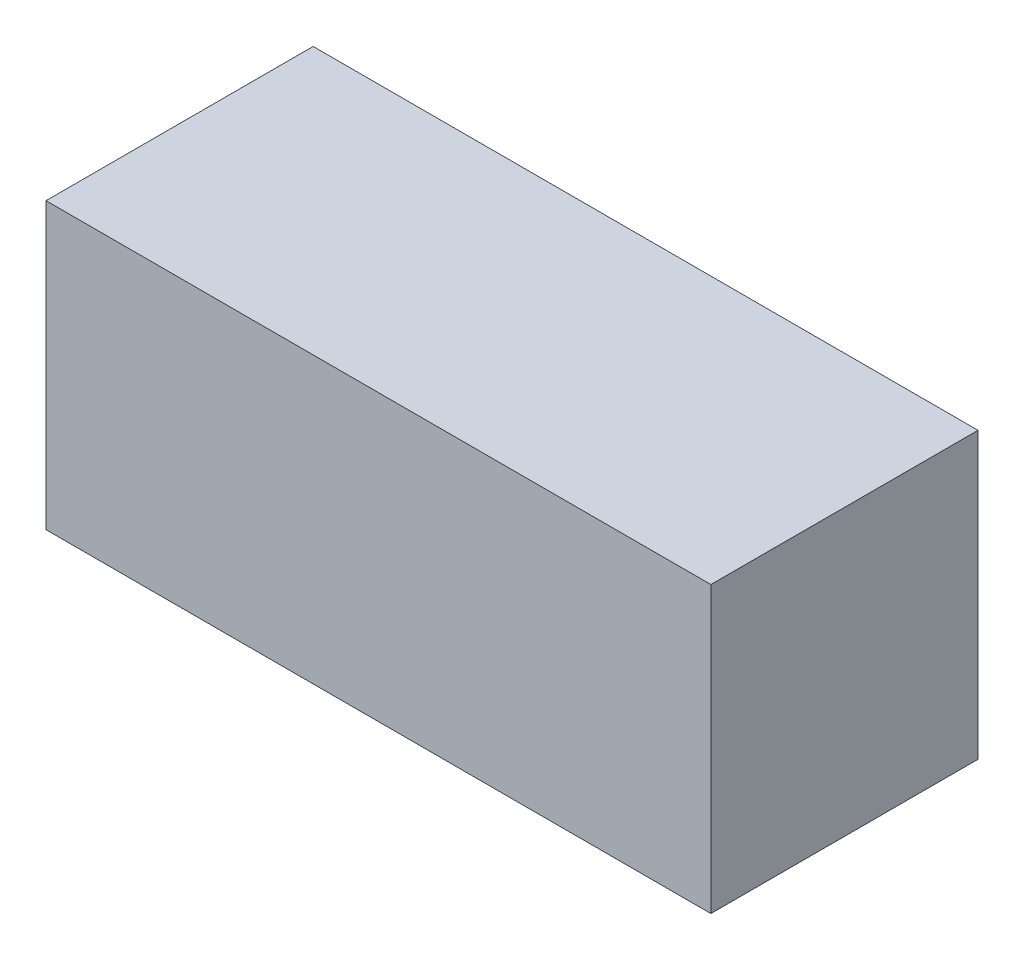
ISO-10303-21;
HEADER;
FILE_DESCRIPTION(('STEP AP214'),'2;1');
FILE_NAME('part.step','',(''),(''),'','','');
FILE_SCHEMA(('AUTOMOTIVE_DESIGN { 1 0 10303 214 1 1 1 1 }'));
ENDSEC;
DATA;
#1=APPLICATION_CONTEXT('core data for automotive mechanical design processes');
#2=APPLICATION_PROTOCOL_DEFINITION('international standard','automotive_design',2000,#1);
#3=PRODUCT_CONTEXT('',#1,'mechanical');
#4=PRODUCT('Part','Part','',(#3));
#5=PRODUCT_RELATED_PRODUCT_CATEGORY('part','',(#4));
#6=PRODUCT_DEFINITION_FORMATION('','',#4);
#7=PRODUCT_DEFINITION_CONTEXT('part definition',#1,'design');
#8=PRODUCT_DEFINITION('design','',#6,#7);
#9=PRODUCT_DEFINITION_SHAPE('','',#8);
#10=(LENGTH_UNIT() NAMED_UNIT(*) SI_UNIT(.MILLI.,.METRE.));
#11=(NAMED_UNIT(*) PLANE_ANGLE_UNIT() SI_UNIT($,.RADIAN.));
#12=(NAMED_UNIT(*) SI_UNIT($,.STERADIAN.) SOLID_ANGLE_UNIT());
#13=UNCERTAINTY_MEASURE_WITH_UNIT(LENGTH_MEASURE(1.E-05),#10,'distance_accuracy_value','');
#14=(GEOMETRIC_REPRESENTATION_CONTEXT(3) GLOBAL_UNCERTAINTY_ASSIGNED_CONTEXT((#13)) GLOBAL_UNIT_ASSIGNED_CONTEXT((#10,
#11,#12)) REPRESENTATION_CONTEXT('',''));
#15=CARTESIAN_POINT('',(0.,0.,0.));
#16=DIRECTION('',(0.,0.,1.));
#17=DIRECTION('',(1.,0.,0.));
#18=AXIS2_PLACEMENT_3D('',#15,#16,#17);
#19=CARTESIAN_POINT('',(-56.,48.,-22.5));
#20=DIRECTION('',(1.,0.,0.));
#21=DIRECTION('',(0.,0.,-1.));
#22=AXIS2_PLACEMENT_3D('',#19,#20,#21);
#23=PLANE('',#22);
#24=DIRECTION('',(0.,0.,1.));
#25=VECTOR('',#24,1.);
#26=CARTESIAN_POINT('',(-56.,0.,-22.5));
#27=LINE('',#26,#25);
#28=CARTESIAN_POINT('',(-56.,0.,-22.5));
#29=VERTEX_POINT('',#28);
#30=CARTESIAN_POINT('',(-56.,0.,22.5));
#31=VERTEX_POINT('',#30);
#32=EDGE_CURVE('E107',#29,#31,#27,.T.);
#33=ORIENTED_EDGE('',*,*,#32,.T.);
#34=DIRECTION('',(0.,-1.,0.));
#35=VECTOR('',#34,1.);
#36=CARTESIAN_POINT('',(-56.,48.,22.5));
#37=LINE('',#36,#35);
#38=CARTESIAN_POINT('',(-56.,48.,22.5));
#39=VERTEX_POINT('',#38);
#40=EDGE_CURVE('E11',#39,#31,#37,.T.);
#41=ORIENTED_EDGE('',*,*,#40,.F.);
#42=DIRECTION('',(0.,0.,1.));
#43=VECTOR('',#42,1.);
#44=CARTESIAN_POINT('',(-56.,48.,-22.5));
#45=LINE('',#44,#43);
#46=CARTESIAN_POINT('',(-56.,48.,-22.5));
#47=VERTEX_POINT('',#46);
#48=EDGE_CURVE('E91',#47,#39,#45,.T.);
#49=ORIENTED_EDGE('',*,*,#48,.F.);
#50=DIRECTION('',(0.,-1.,0.));
#51=VECTOR('',#50,1.);
#52=CARTESIAN_POINT('',(-56.,48.,-22.5));
#53=LINE('',#52,#51);
#54=EDGE_CURVE('E103',#47,#29,#53,.T.);
#55=ORIENTED_EDGE('',*,*,#54,.T.);
#56=EDGE_LOOP('',(#33,#41,#49,#55));
#57=FACE_BOUND('',#56,.T.);
#58=ADVANCED_FACE('F39',(#57),#23,.F.);
#59=CARTESIAN_POINT('',(-56.,48.,22.5));
#60=DIRECTION('',(0.,0.,-1.));
#61=DIRECTION('',(-1.,0.,0.));
#62=AXIS2_PLACEMENT_3D('',#59,#60,#61);
#63=PLANE('',#62);
#64=DIRECTION('',(1.,0.,0.));
#65=VECTOR('',#64,1.);
#66=CARTESIAN_POINT('',(-56.,0.,22.5));
#67=LINE('',#66,#65);
#68=CARTESIAN_POINT('',(56.,0.,22.5));
#69=VERTEX_POINT('',#68);
#70=EDGE_CURVE('E96',#31,#69,#67,.T.);
#71=ORIENTED_EDGE('',*,*,#70,.T.);
#72=DIRECTION('',(0.,-1.,0.));
#73=VECTOR('',#72,1.);
#74=CARTESIAN_POINT('',(56.,48.,22.5));
#75=LINE('',#74,#73);
#76=CARTESIAN_POINT('',(56.,48.,22.5));
#77=VERTEX_POINT('',#76);
#78=EDGE_CURVE('E48',#77,#69,#75,.T.);
#79=ORIENTED_EDGE('',*,*,#78,.F.);
#80=DIRECTION('',(1.,0.,0.));
#81=VECTOR('',#80,1.);
#82=CARTESIAN_POINT('',(-56.,48.,22.5));
#83=LINE('',#82,#81);
#84=EDGE_CURVE('E86',#39,#77,#83,.T.);
#85=ORIENTED_EDGE('',*,*,#84,.F.);
#86=ORIENTED_EDGE('',*,*,#40,.T.);
#87=EDGE_LOOP('',(#71,#79,#85,#86));
#88=FACE_BOUND('',#87,.T.);
#89=ADVANCED_FACE('F95',(#88),#63,.F.);
#90=CARTESIAN_POINT('',(56.,48.,-22.5));
#91=DIRECTION('',(-1.,0.,0.));
#92=DIRECTION('',(0.,0.,1.));
#93=AXIS2_PLACEMENT_3D('',#90,#91,#92);
#94=PLANE('',#93);
#95=DIRECTION('',(0.,0.,-1.));
#96=VECTOR('',#95,1.);
#97=CARTESIAN_POINT('',(56.,0.,-22.5));
#98=LINE('',#97,#96);
#99=CARTESIAN_POINT('',(56.,0.,-22.5));
#100=VERTEX_POINT('',#99);
#101=EDGE_CURVE('E73',#69,#100,#98,.T.);
#102=ORIENTED_EDGE('',*,*,#101,.T.);
#103=DIRECTION('',(0.,-1.,0.));
#104=VECTOR('',#103,1.);
#105=CARTESIAN_POINT('',(56.,48.,-22.5));
#106=LINE('',#105,#104);
#107=CARTESIAN_POINT('',(56.,48.,-22.5));
#108=VERTEX_POINT('',#107);
#109=EDGE_CURVE('E98',#108,#100,#106,.T.);
#110=ORIENTED_EDGE('',*,*,#109,.F.);
#111=DIRECTION('',(0.,0.,-1.));
#112=VECTOR('',#111,1.);
#113=CARTESIAN_POINT('',(56.,48.,-22.5));
#114=LINE('',#113,#112);
#115=EDGE_CURVE('E89',#77,#108,#114,.T.);
#116=ORIENTED_EDGE('',*,*,#115,.F.);
#117=ORIENTED_EDGE('',*,*,#78,.T.);
#118=EDGE_LOOP('',(#102,#110,#116,#117));
#119=FACE_BOUND('',#118,.T.);
#120=ADVANCED_FACE('F99',(#119),#94,.F.);
#121=CARTESIAN_POINT('',(-56.,48.,-22.5));
#122=DIRECTION('',(0.,0.,1.));
#123=DIRECTION('',(1.,0.,0.));
#124=AXIS2_PLACEMENT_3D('',#121,#122,#123);
#125=PLANE('',#124);
#126=DIRECTION('',(-1.,0.,0.));
#127=VECTOR('',#126,1.);
#128=CARTESIAN_POINT('',(-56.,0.,-22.5));
#129=LINE('',#128,#127);
#130=EDGE_CURVE('E79',#100,#29,#129,.T.);
#131=ORIENTED_EDGE('',*,*,#130,.T.);
#132=ORIENTED_EDGE('',*,*,#54,.F.);
#133=DIRECTION('',(-1.,0.,0.));
#134=VECTOR('',#133,1.);
#135=CARTESIAN_POINT('',(-56.,48.,-22.5));
#136=LINE('',#135,#134);
#137=EDGE_CURVE('E56',#108,#47,#136,.T.);
#138=ORIENTED_EDGE('',*,*,#137,.F.);
#139=ORIENTED_EDGE('',*,*,#109,.T.);
#140=EDGE_LOOP('',(#131,#132,#138,#139));
#141=FACE_BOUND('',#140,.T.);
#142=ADVANCED_FACE('F120',(#141),#125,.F.);
#143=CARTESIAN_POINT('',(0.,48.,0.));
#144=DIRECTION('',(0.,1.,0.));
#145=DIRECTION('',(0.,0.,1.));
#146=AXIS2_PLACEMENT_3D('',#143,#144,#145);
#147=PLANE('',#146);
#148=ORIENTED_EDGE('',*,*,#48,.T.);
#149=ORIENTED_EDGE('',*,*,#84,.T.);
#150=ORIENTED_EDGE('',*,*,#115,.T.);
#151=ORIENTED_EDGE('',*,*,#137,.T.);
#152=EDGE_LOOP('',(#148,#149,#150,#151));
#153=FACE_BOUND('',#152,.T.);
#154=ADVANCED_FACE('F87',(#153),#147,.T.);
#155=CARTESIAN_POINT('',(0.,0.,0.));
#156=DIRECTION('',(0.,1.,0.));
#157=DIRECTION('',(0.,0.,1.));
#158=AXIS2_PLACEMENT_3D('',#155,#156,#157);
#159=PLANE('',#158);
#160=ORIENTED_EDGE('',*,*,#32,.F.);
#161=ORIENTED_EDGE('',*,*,#130,.F.);
#162=ORIENTED_EDGE('',*,*,#101,.F.);
#163=ORIENTED_EDGE('',*,*,#70,.F.);
#164=EDGE_LOOP('',(#160,#161,#162,#163));
#165=FACE_BOUND('',#164,.T.);
#166=ADVANCED_FACE('F123',(#165),#159,.F.);
#167=CLOSED_SHELL('',(#58,#89,#120,#142,#154,#166));
#168=MANIFOLD_SOLID_BREP('B2',#167);
#169=ADVANCED_BREP_SHAPE_REPRESENTATION('',(#18,#168),#14);
#170=SHAPE_DEFINITION_REPRESENTATION(#9,#169);
ENDSEC;
END-ISO-10303-21;
